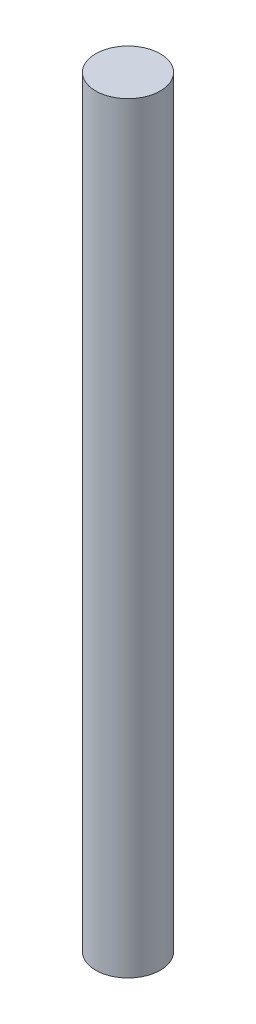
ISO-10303-21;
HEADER;
FILE_DESCRIPTION(('STEP AP214'),'2;1');
FILE_NAME('part.step','',(''),(''),'','','');
FILE_SCHEMA(('AUTOMOTIVE_DESIGN { 1 0 10303 214 1 1 1 1 }'));
ENDSEC;
DATA;
#1=APPLICATION_CONTEXT('core data for automotive mechanical design processes');
#2=APPLICATION_PROTOCOL_DEFINITION('international standard','automotive_design',2000,#1);
#3=PRODUCT_CONTEXT('',#1,'mechanical');
#4=PRODUCT('Part','Part','',(#3));
#5=PRODUCT_RELATED_PRODUCT_CATEGORY('part','',(#4));
#6=PRODUCT_DEFINITION_FORMATION('','',#4);
#7=PRODUCT_DEFINITION_CONTEXT('part definition',#1,'design');
#8=PRODUCT_DEFINITION('design','',#6,#7);
#9=PRODUCT_DEFINITION_SHAPE('','',#8);
#10=(LENGTH_UNIT() NAMED_UNIT(*) SI_UNIT(.MILLI.,.METRE.));
#11=(NAMED_UNIT(*) PLANE_ANGLE_UNIT() SI_UNIT($,.RADIAN.));
#12=(NAMED_UNIT(*) SI_UNIT($,.STERADIAN.) SOLID_ANGLE_UNIT());
#13=UNCERTAINTY_MEASURE_WITH_UNIT(LENGTH_MEASURE(1.E-05),#10,'distance_accuracy_value','');
#14=(GEOMETRIC_REPRESENTATION_CONTEXT(3) GLOBAL_UNCERTAINTY_ASSIGNED_CONTEXT((#13)) GLOBAL_UNIT_ASSIGNED_CONTEXT((#10,
#11,#12)) REPRESENTATION_CONTEXT('',''));
#15=CARTESIAN_POINT('',(0.,0.,0.));
#16=DIRECTION('',(0.,0.,1.));
#17=DIRECTION('',(1.,0.,0.));
#18=AXIS2_PLACEMENT_3D('',#15,#16,#17);
#19=CARTESIAN_POINT('',(0.,-22.,0.));
#20=DIRECTION('',(0.,1.,0.));
#21=DIRECTION('',(0.,0.,1.));
#22=AXIS2_PLACEMENT_3D('',#19,#20,#21);
#23=CYLINDRICAL_SURFACE('',#22,2.5);
#24=CARTESIAN_POINT('',(0.,-22.,0.));
#25=DIRECTION('',(0.,1.,0.));
#26=DIRECTION('',(0.,0.,1.));
#27=AXIS2_PLACEMENT_3D('',#24,#25,#26);
#28=CIRCLE('',#27,2.5);
#29=CARTESIAN_POINT('',(0.,-22.,2.5));
#30=VERTEX_POINT('',#29);
#31=EDGE_CURVE('E10',#30,#30,#28,.T.);
#32=ORIENTED_EDGE('',*,*,#31,.T.);
#33=EDGE_LOOP('',(#32));
#34=FACE_BOUND('',#33,.T.);
#35=CARTESIAN_POINT('',(0.,37.,0.));
#36=DIRECTION('',(0.,1.,0.));
#37=DIRECTION('',(0.,0.,1.));
#38=AXIS2_PLACEMENT_3D('',#35,#36,#37);
#39=CIRCLE('',#38,2.5);
#40=CARTESIAN_POINT('',(0.,37.,2.5));
#41=VERTEX_POINT('',#40);
#42=EDGE_CURVE('E36',#41,#41,#39,.T.);
#43=ORIENTED_EDGE('',*,*,#42,.F.);
#44=EDGE_LOOP('',(#43));
#45=FACE_BOUND('',#44,.T.);
#46=ADVANCED_FACE('F30',(#34,#45),#23,.T.);
#47=CARTESIAN_POINT('',(0.,-22.,0.));
#48=DIRECTION('',(0.,1.,0.));
#49=DIRECTION('',(0.,0.,1.));
#50=AXIS2_PLACEMENT_3D('',#47,#48,#49);
#51=PLANE('',#50);
#52=ORIENTED_EDGE('',*,*,#31,.F.);
#53=EDGE_LOOP('',(#52));
#54=FACE_BOUND('',#53,.T.);
#55=ADVANCED_FACE('F45',(#54),#51,.F.);
#56=CARTESIAN_POINT('',(0.,37.,0.));
#57=DIRECTION('',(0.,1.,0.));
#58=DIRECTION('',(0.,0.,1.));
#59=AXIS2_PLACEMENT_3D('',#56,#57,#58);
#60=PLANE('',#59);
#61=ORIENTED_EDGE('',*,*,#42,.T.);
#62=EDGE_LOOP('',(#61));
#63=FACE_BOUND('',#62,.T.);
#64=ADVANCED_FACE('F42',(#63),#60,.T.);
#65=CLOSED_SHELL('',(#46,#55,#64));
#66=MANIFOLD_SOLID_BREP('B2',#65);
#67=ADVANCED_BREP_SHAPE_REPRESENTATION('',(#18,#66),#14);
#68=SHAPE_DEFINITION_REPRESENTATION(#9,#67);
ENDSEC;
END-ISO-10303-21;
